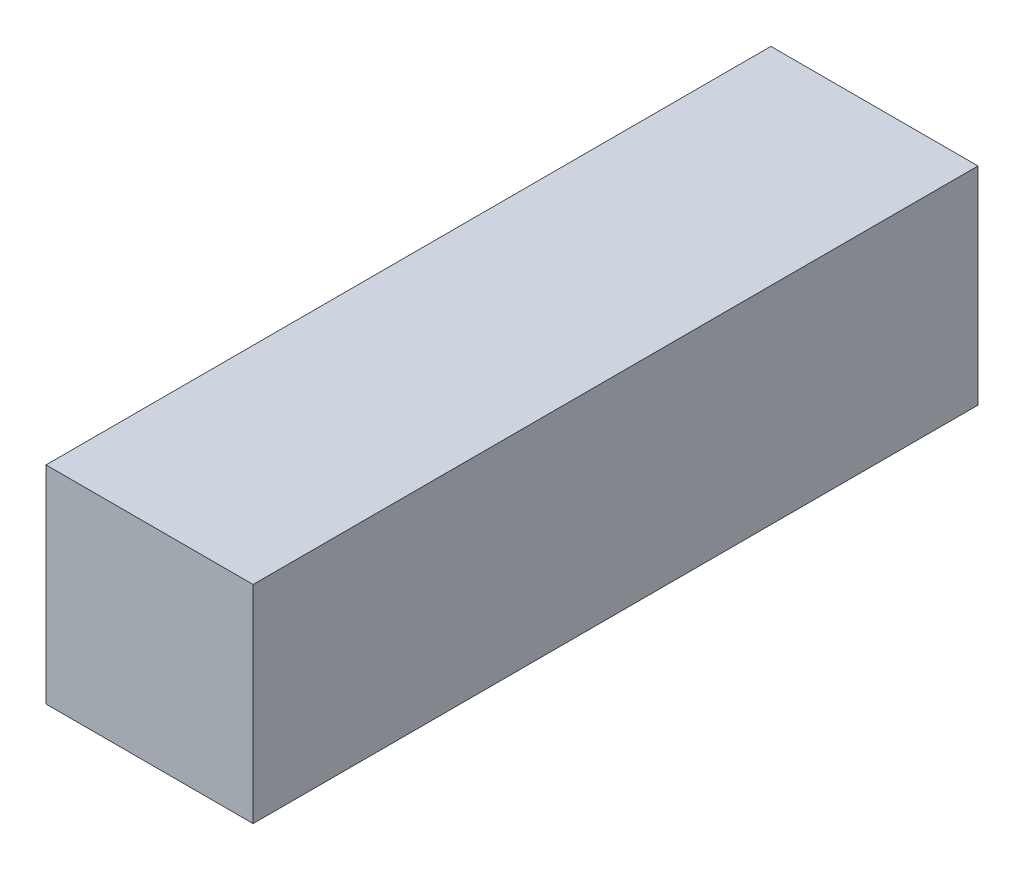
ISO-10303-21;
HEADER;
FILE_DESCRIPTION(('STEP AP214'),'2;1');
FILE_NAME('part.step','',(''),(''),'','','');
FILE_SCHEMA(('AUTOMOTIVE_DESIGN { 1 0 10303 214 1 1 1 1 }'));
ENDSEC;
DATA;
#1=APPLICATION_CONTEXT('core data for automotive mechanical design processes');
#2=APPLICATION_PROTOCOL_DEFINITION('international standard','automotive_design',2000,#1);
#3=PRODUCT_CONTEXT('',#1,'mechanical');
#4=PRODUCT('Part','Part','',(#3));
#5=PRODUCT_RELATED_PRODUCT_CATEGORY('part','',(#4));
#6=PRODUCT_DEFINITION_FORMATION('','',#4);
#7=PRODUCT_DEFINITION_CONTEXT('part definition',#1,'design');
#8=PRODUCT_DEFINITION('design','',#6,#7);
#9=PRODUCT_DEFINITION_SHAPE('','',#8);
#10=(LENGTH_UNIT() NAMED_UNIT(*) SI_UNIT(.MILLI.,.METRE.));
#11=(NAMED_UNIT(*) PLANE_ANGLE_UNIT() SI_UNIT($,.RADIAN.));
#12=(NAMED_UNIT(*) SI_UNIT($,.STERADIAN.) SOLID_ANGLE_UNIT());
#13=UNCERTAINTY_MEASURE_WITH_UNIT(LENGTH_MEASURE(1.E-05),#10,'distance_accuracy_value','');
#14=(GEOMETRIC_REPRESENTATION_CONTEXT(3) GLOBAL_UNCERTAINTY_ASSIGNED_CONTEXT((#13)) GLOBAL_UNIT_ASSIGNED_CONTEXT((#10,
#11,#12)) REPRESENTATION_CONTEXT('',''));
#15=CARTESIAN_POINT('',(0.,0.,0.));
#16=DIRECTION('',(0.,0.,1.));
#17=DIRECTION('',(1.,0.,0.));
#18=AXIS2_PLACEMENT_3D('',#15,#16,#17);
#19=CARTESIAN_POINT('',(4.,8.5,-28.));
#20=DIRECTION('',(1.,0.,0.));
#21=DIRECTION('',(0.,0.,-1.));
#22=AXIS2_PLACEMENT_3D('',#19,#20,#21);
#23=PLANE('',#22);
#24=DIRECTION('',(0.,1.,0.));
#25=VECTOR('',#24,1.);
#26=CARTESIAN_POINT('',(4.,8.5,0.));
#27=LINE('',#26,#25);
#28=CARTESIAN_POINT('',(4.,8.5,0.));
#29=VERTEX_POINT('',#28);
#30=CARTESIAN_POINT('',(4.,16.5,0.));
#31=VERTEX_POINT('',#30);
#32=EDGE_CURVE('E97',#29,#31,#27,.T.);
#33=ORIENTED_EDGE('',*,*,#32,.F.);
#34=DIRECTION('',(0.,0.,1.));
#35=VECTOR('',#34,1.);
#36=CARTESIAN_POINT('',(4.,8.5,-28.));
#37=LINE('',#36,#35);
#38=CARTESIAN_POINT('',(4.,8.5,-28.));
#39=VERTEX_POINT('',#38);
#40=EDGE_CURVE('E11',#39,#29,#37,.T.);
#41=ORIENTED_EDGE('',*,*,#40,.F.);
#42=DIRECTION('',(0.,1.,0.));
#43=VECTOR('',#42,1.);
#44=CARTESIAN_POINT('',(4.,8.5,-28.));
#45=LINE('',#44,#43);
#46=CARTESIAN_POINT('',(4.,16.5,-28.));
#47=VERTEX_POINT('',#46);
#48=EDGE_CURVE('E92',#39,#47,#45,.T.);
#49=ORIENTED_EDGE('',*,*,#48,.T.);
#50=DIRECTION('',(0.,0.,1.));
#51=VECTOR('',#50,1.);
#52=CARTESIAN_POINT('',(4.,16.5,-28.));
#53=LINE('',#52,#51);
#54=EDGE_CURVE('E35',#47,#31,#53,.T.);
#55=ORIENTED_EDGE('',*,*,#54,.T.);
#56=EDGE_LOOP('',(#33,#41,#49,#55));
#57=FACE_BOUND('',#56,.T.);
#58=ADVANCED_FACE('F32',(#57),#23,.T.);
#59=CARTESIAN_POINT('',(4.,8.5,-28.));
#60=DIRECTION('',(0.,1.,0.));
#61=DIRECTION('',(-1.,0.,0.));
#62=AXIS2_PLACEMENT_3D('',#59,#60,#61);
#63=PLANE('',#62);
#64=DIRECTION('',(-1.,0.,0.));
#65=VECTOR('',#64,1.);
#66=CARTESIAN_POINT('',(4.,8.5,0.));
#67=LINE('',#66,#65);
#68=CARTESIAN_POINT('',(-4.,8.5,0.));
#69=VERTEX_POINT('',#68);
#70=EDGE_CURVE('E65',#29,#69,#67,.T.);
#71=ORIENTED_EDGE('',*,*,#70,.T.);
#72=DIRECTION('',(0.,0.,1.));
#73=VECTOR('',#72,1.);
#74=CARTESIAN_POINT('',(-4.,8.5,-28.));
#75=LINE('',#74,#73);
#76=CARTESIAN_POINT('',(-4.,8.5,-28.));
#77=VERTEX_POINT('',#76);
#78=EDGE_CURVE('E41',#77,#69,#75,.T.);
#79=ORIENTED_EDGE('',*,*,#78,.F.);
#80=DIRECTION('',(-1.,0.,0.));
#81=VECTOR('',#80,1.);
#82=CARTESIAN_POINT('',(4.,8.5,-28.));
#83=LINE('',#82,#81);
#84=EDGE_CURVE('E82',#39,#77,#83,.T.);
#85=ORIENTED_EDGE('',*,*,#84,.F.);
#86=ORIENTED_EDGE('',*,*,#40,.T.);
#87=EDGE_LOOP('',(#71,#79,#85,#86));
#88=FACE_BOUND('',#87,.T.);
#89=ADVANCED_FACE('F107',(#88),#63,.F.);
#90=CARTESIAN_POINT('',(-4.,8.5,-28.));
#91=DIRECTION('',(1.,0.,0.));
#92=DIRECTION('',(0.,0.,-1.));
#93=AXIS2_PLACEMENT_3D('',#90,#91,#92);
#94=PLANE('',#93);
#95=DIRECTION('',(0.,1.,0.));
#96=VECTOR('',#95,1.);
#97=CARTESIAN_POINT('',(-4.,8.5,0.));
#98=LINE('',#97,#96);
#99=CARTESIAN_POINT('',(-4.,16.5,0.));
#100=VERTEX_POINT('',#99);
#101=EDGE_CURVE('E89',#69,#100,#98,.T.);
#102=ORIENTED_EDGE('',*,*,#101,.T.);
#103=DIRECTION('',(0.,0.,1.));
#104=VECTOR('',#103,1.);
#105=CARTESIAN_POINT('',(-4.,16.5,-28.));
#106=LINE('',#105,#104);
#107=CARTESIAN_POINT('',(-4.,16.5,-28.));
#108=VERTEX_POINT('',#107);
#109=EDGE_CURVE('E86',#108,#100,#106,.T.);
#110=ORIENTED_EDGE('',*,*,#109,.F.);
#111=DIRECTION('',(0.,1.,0.));
#112=VECTOR('',#111,1.);
#113=CARTESIAN_POINT('',(-4.,8.5,-28.));
#114=LINE('',#113,#112);
#115=EDGE_CURVE('E77',#77,#108,#114,.T.);
#116=ORIENTED_EDGE('',*,*,#115,.F.);
#117=ORIENTED_EDGE('',*,*,#78,.T.);
#118=EDGE_LOOP('',(#102,#110,#116,#117));
#119=FACE_BOUND('',#118,.T.);
#120=ADVANCED_FACE('F87',(#119),#94,.F.);
#121=CARTESIAN_POINT('',(4.,16.5,-28.));
#122=DIRECTION('',(0.,1.,0.));
#123=DIRECTION('',(-1.,0.,0.));
#124=AXIS2_PLACEMENT_3D('',#121,#122,#123);
#125=PLANE('',#124);
#126=DIRECTION('',(-1.,0.,0.));
#127=VECTOR('',#126,1.);
#128=CARTESIAN_POINT('',(4.,16.5,0.));
#129=LINE('',#128,#127);
#130=EDGE_CURVE('E100',#31,#100,#129,.T.);
#131=ORIENTED_EDGE('',*,*,#130,.F.);
#132=ORIENTED_EDGE('',*,*,#54,.F.);
#133=DIRECTION('',(-1.,0.,0.));
#134=VECTOR('',#133,1.);
#135=CARTESIAN_POINT('',(4.,16.5,-28.));
#136=LINE('',#135,#134);
#137=EDGE_CURVE('E81',#47,#108,#136,.T.);
#138=ORIENTED_EDGE('',*,*,#137,.T.);
#139=ORIENTED_EDGE('',*,*,#109,.T.);
#140=EDGE_LOOP('',(#131,#132,#138,#139));
#141=FACE_BOUND('',#140,.T.);
#142=ADVANCED_FACE('F91',(#141),#125,.T.);
#143=CARTESIAN_POINT('',(0.,0.,-28.));
#144=DIRECTION('',(0.,0.,1.));
#145=DIRECTION('',(1.,0.,0.));
#146=AXIS2_PLACEMENT_3D('',#143,#144,#145);
#147=PLANE('',#146);
#148=ORIENTED_EDGE('',*,*,#48,.F.);
#149=ORIENTED_EDGE('',*,*,#84,.T.);
#150=ORIENTED_EDGE('',*,*,#115,.T.);
#151=ORIENTED_EDGE('',*,*,#137,.F.);
#152=EDGE_LOOP('',(#148,#149,#150,#151));
#153=FACE_BOUND('',#152,.T.);
#154=ADVANCED_FACE('F80',(#153),#147,.F.);
#155=CARTESIAN_POINT('',(0.,0.,0.));
#156=DIRECTION('',(0.,0.,1.));
#157=DIRECTION('',(1.,0.,0.));
#158=AXIS2_PLACEMENT_3D('',#155,#156,#157);
#159=PLANE('',#158);
#160=ORIENTED_EDGE('',*,*,#32,.T.);
#161=ORIENTED_EDGE('',*,*,#130,.T.);
#162=ORIENTED_EDGE('',*,*,#101,.F.);
#163=ORIENTED_EDGE('',*,*,#70,.F.);
#164=EDGE_LOOP('',(#160,#161,#162,#163));
#165=FACE_BOUND('',#164,.T.);
#166=ADVANCED_FACE('F105',(#165),#159,.T.);
#167=CLOSED_SHELL('',(#58,#89,#120,#142,#154,#166));
#168=MANIFOLD_SOLID_BREP('B2',#167);
#169=ADVANCED_BREP_SHAPE_REPRESENTATION('',(#18,#168),#14);
#170=SHAPE_DEFINITION_REPRESENTATION(#9,#169);
ENDSEC;
END-ISO-10303-21;
